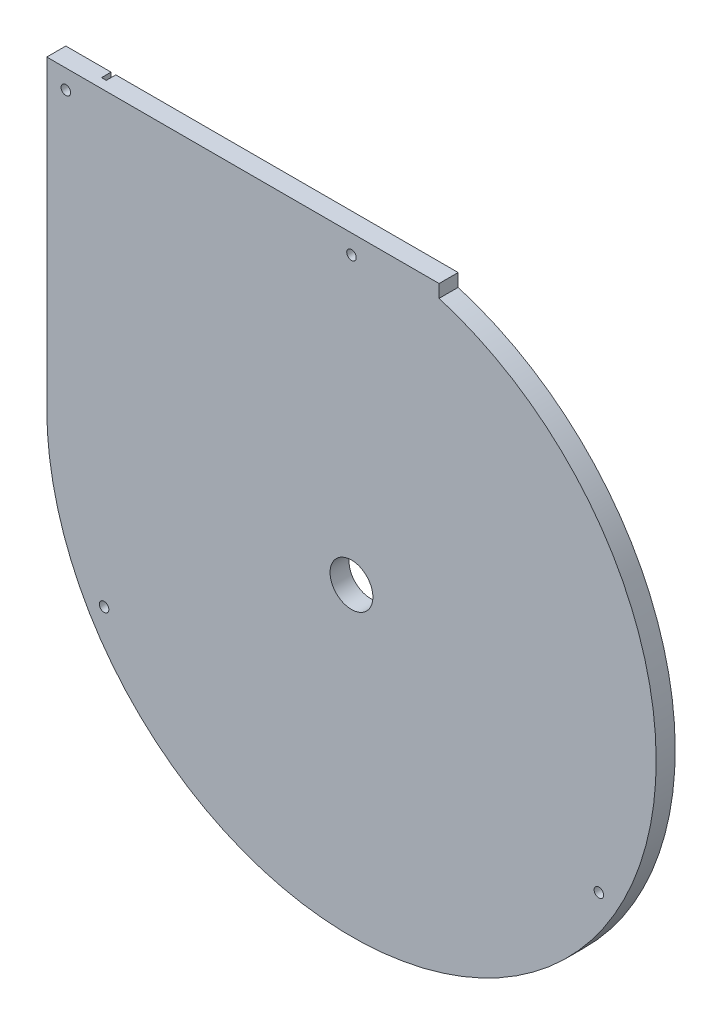
ISO-10303-21;
HEADER;
FILE_DESCRIPTION(('STEP AP214'),'2;1');
FILE_NAME('part.step','',(''),(''),'','','');
FILE_SCHEMA(('AUTOMOTIVE_DESIGN { 1 0 10303 214 1 1 1 1 }'));
ENDSEC;
DATA;
#1=APPLICATION_CONTEXT('core data for automotive mechanical design processes');
#2=APPLICATION_PROTOCOL_DEFINITION('international standard','automotive_design',2000,#1);
#3=PRODUCT_CONTEXT('',#1,'mechanical');
#4=PRODUCT('Part','Part','',(#3));
#5=PRODUCT_RELATED_PRODUCT_CATEGORY('part','',(#4));
#6=PRODUCT_DEFINITION_FORMATION('','',#4);
#7=PRODUCT_DEFINITION_CONTEXT('part definition',#1,'design');
#8=PRODUCT_DEFINITION('design','',#6,#7);
#9=PRODUCT_DEFINITION_SHAPE('','',#8);
#10=(LENGTH_UNIT() NAMED_UNIT(*) SI_UNIT(.MILLI.,.METRE.));
#11=(NAMED_UNIT(*) PLANE_ANGLE_UNIT() SI_UNIT($,.RADIAN.));
#12=(NAMED_UNIT(*) SI_UNIT($,.STERADIAN.) SOLID_ANGLE_UNIT());
#13=UNCERTAINTY_MEASURE_WITH_UNIT(LENGTH_MEASURE(1.E-05),#10,'distance_accuracy_value','');
#14=(GEOMETRIC_REPRESENTATION_CONTEXT(3) GLOBAL_UNCERTAINTY_ASSIGNED_CONTEXT((#13)) GLOBAL_UNIT_ASSIGNED_CONTEXT((#10,
#11,#12)) REPRESENTATION_CONTEXT('',''));
#15=CARTESIAN_POINT('',(0.,0.,0.));
#16=DIRECTION('',(0.,0.,1.));
#17=DIRECTION('',(1.,0.,0.));
#18=AXIS2_PLACEMENT_3D('',#15,#16,#17);
#19=CARTESIAN_POINT('',(0.,0.,12.7));
#20=DIRECTION('',(0.,0.,1.));
#21=DIRECTION('',(1.,0.,0.));
#22=AXIS2_PLACEMENT_3D('',#19,#20,#21);
#23=PLANE('',#22);
#24=CARTESIAN_POINT('',(0.,190.5,12.7));
#25=DIRECTION('',(0.,0.,-1.));
#26=DIRECTION('',(-1.,0.,0.));
#27=AXIS2_PLACEMENT_3D('',#24,#25,#26);
#28=CIRCLE('',#27,3.175);
#29=CARTESIAN_POINT('',(-3.17499999999999,190.5,12.7));
#30=VERTEX_POINT('',#29);
#31=EDGE_CURVE('E427',#30,#30,#28,.T.);
#32=ORIENTED_EDGE('',*,*,#31,.T.);
#33=EDGE_LOOP('',(#32));
#34=FACE_BOUND('',#33,.T.);
#35=CARTESIAN_POINT('',(-164.977839420936,-95.2500000000001,12.7));
#36=DIRECTION('',(0.,0.,-1.));
#37=DIRECTION('',(-1.,0.,0.));
#38=AXIS2_PLACEMENT_3D('',#35,#36,#37);
#39=CIRCLE('',#38,3.175);
#40=CARTESIAN_POINT('',(-168.152839420935,-95.2500000000001,12.7));
#41=VERTEX_POINT('',#40);
#42=EDGE_CURVE('E431',#41,#41,#39,.T.);
#43=ORIENTED_EDGE('',*,*,#42,.T.);
#44=EDGE_LOOP('',(#43));
#45=FACE_BOUND('',#44,.T.);
#46=CARTESIAN_POINT('',(-190.5,190.5,12.7));
#47=DIRECTION('',(0.,0.,-1.));
#48=DIRECTION('',(-1.,0.,0.));
#49=AXIS2_PLACEMENT_3D('',#46,#47,#48);
#50=CIRCLE('',#49,3.175);
#51=CARTESIAN_POINT('',(-193.675,190.5,12.7));
#52=VERTEX_POINT('',#51);
#53=EDGE_CURVE('E440',#52,#52,#50,.T.);
#54=ORIENTED_EDGE('',*,*,#53,.T.);
#55=EDGE_LOOP('',(#54));
#56=FACE_BOUND('',#55,.T.);
#57=CARTESIAN_POINT('',(164.977839420936,-95.25,12.7));
#58=DIRECTION('',(0.,0.,-1.));
#59=DIRECTION('',(-1.,0.,0.));
#60=AXIS2_PLACEMENT_3D('',#57,#58,#59);
#61=CIRCLE('',#60,3.175);
#62=CARTESIAN_POINT('',(161.802839420936,-95.25,12.7));
#63=VERTEX_POINT('',#62);
#64=EDGE_CURVE('E183',#63,#63,#61,.T.);
#65=ORIENTED_EDGE('',*,*,#64,.T.);
#66=EDGE_LOOP('',(#65));
#67=FACE_BOUND('',#66,.T.);
#68=DIRECTION('',(0.,1.,0.));
#69=VECTOR('',#68,1.);
#70=CARTESIAN_POINT('',(58.4327048944713,1.88963453154846E-13,12.7));
#71=LINE('',#70,#69);
#72=CARTESIAN_POINT('',(58.4327048944707,194.617211465779,12.7));
#73=VERTEX_POINT('',#72);
#74=CARTESIAN_POINT('',(58.4327048944707,203.2,12.7));
#75=VERTEX_POINT('',#74);
#76=EDGE_CURVE('E155',#73,#75,#71,.T.);
#77=ORIENTED_EDGE('',*,*,#76,.T.);
#78=DIRECTION('',(-1.,0.,0.));
#79=VECTOR('',#78,1.);
#80=CARTESIAN_POINT('',(203.2,203.2,12.7));
#81=LINE('',#80,#79);
#82=CARTESIAN_POINT('',(-203.2,203.2,12.7));
#83=VERTEX_POINT('',#82);
#84=EDGE_CURVE('E82',#75,#83,#81,.T.);
#85=ORIENTED_EDGE('',*,*,#84,.T.);
#86=DIRECTION('',(0.,-1.,0.));
#87=VECTOR('',#86,1.);
#88=CARTESIAN_POINT('',(-203.2,-203.2,12.7));
#89=LINE('',#88,#87);
#90=CARTESIAN_POINT('',(-203.2,0.,12.7));
#91=VERTEX_POINT('',#90);
#92=EDGE_CURVE('E158',#83,#91,#89,.T.);
#93=ORIENTED_EDGE('',*,*,#92,.T.);
#94=CARTESIAN_POINT('',(0.,0.,12.7));
#95=DIRECTION('',(0.,0.,-1.));
#96=DIRECTION('',(-1.,0.,0.));
#97=AXIS2_PLACEMENT_3D('',#94,#95,#96);
#98=CIRCLE('',#97,203.2);
#99=EDGE_CURVE('E151',#91,#73,#98,.F.);
#100=ORIENTED_EDGE('',*,*,#99,.T.);
#101=EDGE_LOOP('',(#77,#85,#93,#100));
#102=FACE_BOUND('',#101,.T.);
#103=CARTESIAN_POINT('',(0.,0.,12.7));
#104=DIRECTION('',(0.,0.,-1.));
#105=DIRECTION('',(-1.,0.,0.));
#106=AXIS2_PLACEMENT_3D('',#103,#104,#105);
#107=CIRCLE('',#106,14.2875);
#108=CARTESIAN_POINT('',(-14.2875,0.,12.7));
#109=VERTEX_POINT('',#108);
#110=EDGE_CURVE('E172',#109,#109,#107,.T.);
#111=ORIENTED_EDGE('',*,*,#110,.T.);
#112=EDGE_LOOP('',(#111));
#113=FACE_BOUND('',#112,.T.);
#114=ADVANCED_FACE('F74',(#34,#45,#56,#67,#102,#113),#23,.T.);
#115=CARTESIAN_POINT('',(0.,0.,0.));
#116=DIRECTION('',(0.,0.,1.));
#117=DIRECTION('',(1.,0.,0.));
#118=AXIS2_PLACEMENT_3D('',#115,#116,#117);
#119=PLANE('',#118);
#120=CARTESIAN_POINT('',(0.,190.5,0.));
#121=DIRECTION('',(0.,0.,-1.));
#122=DIRECTION('',(-1.,0.,0.));
#123=AXIS2_PLACEMENT_3D('',#120,#121,#122);
#124=CIRCLE('',#123,3.175);
#125=CARTESIAN_POINT('',(-3.17499999999999,190.5,0.));
#126=VERTEX_POINT('',#125);
#127=EDGE_CURVE('E430',#126,#126,#124,.T.);
#128=ORIENTED_EDGE('',*,*,#127,.F.);
#129=EDGE_LOOP('',(#128));
#130=FACE_BOUND('',#129,.T.);
#131=CARTESIAN_POINT('',(-164.977839420936,-95.2500000000001,0.));
#132=DIRECTION('',(0.,0.,-1.));
#133=DIRECTION('',(-1.,0.,0.));
#134=AXIS2_PLACEMENT_3D('',#131,#132,#133);
#135=CIRCLE('',#134,3.175);
#136=CARTESIAN_POINT('',(-168.152839420935,-95.2500000000001,0.));
#137=VERTEX_POINT('',#136);
#138=EDGE_CURVE('E435',#137,#137,#135,.T.);
#139=ORIENTED_EDGE('',*,*,#138,.F.);
#140=EDGE_LOOP('',(#139));
#141=FACE_BOUND('',#140,.T.);
#142=CARTESIAN_POINT('',(-190.5,190.5,0.));
#143=DIRECTION('',(0.,0.,-1.));
#144=DIRECTION('',(-1.,0.,0.));
#145=AXIS2_PLACEMENT_3D('',#142,#143,#144);
#146=CIRCLE('',#145,3.175);
#147=CARTESIAN_POINT('',(-193.675,190.5,0.));
#148=VERTEX_POINT('',#147);
#149=EDGE_CURVE('E443',#148,#148,#146,.T.);
#150=ORIENTED_EDGE('',*,*,#149,.F.);
#151=EDGE_LOOP('',(#150));
#152=FACE_BOUND('',#151,.T.);
#153=CARTESIAN_POINT('',(164.977839420936,-95.25,0.));
#154=DIRECTION('',(0.,0.,-1.));
#155=DIRECTION('',(-1.,0.,0.));
#156=AXIS2_PLACEMENT_3D('',#153,#154,#155);
#157=CIRCLE('',#156,3.175);
#158=CARTESIAN_POINT('',(161.802839420936,-95.25,0.));
#159=VERTEX_POINT('',#158);
#160=EDGE_CURVE('E175',#159,#159,#157,.T.);
#161=ORIENTED_EDGE('',*,*,#160,.F.);
#162=EDGE_LOOP('',(#161));
#163=FACE_BOUND('',#162,.T.);
#164=CARTESIAN_POINT('',(0.,0.,0.));
#165=DIRECTION('',(0.,0.,-1.));
#166=DIRECTION('',(-1.,0.,0.));
#167=AXIS2_PLACEMENT_3D('',#164,#165,#166);
#168=CIRCLE('',#167,14.2875);
#169=CARTESIAN_POINT('',(-14.2875,0.,0.));
#170=VERTEX_POINT('',#169);
#171=EDGE_CURVE('E181',#170,#170,#168,.T.);
#172=ORIENTED_EDGE('',*,*,#171,.F.);
#173=EDGE_LOOP('',(#172));
#174=FACE_BOUND('',#173,.T.);
#175=DIRECTION('',(-1.,0.,0.));
#176=VECTOR('',#175,1.);
#177=CARTESIAN_POINT('',(203.2,203.2,0.));
#178=LINE('',#177,#176);
#179=CARTESIAN_POINT('',(58.4327048944707,203.2,0.));
#180=VERTEX_POINT('',#179);
#181=CARTESIAN_POINT('',(-169.8625,203.2,0.));
#182=VERTEX_POINT('',#181);
#183=EDGE_CURVE('E233',#180,#182,#178,.T.);
#184=ORIENTED_EDGE('',*,*,#183,.F.);
#185=DIRECTION('',(0.,1.,0.));
#186=VECTOR('',#185,1.);
#187=CARTESIAN_POINT('',(58.4327048944713,1.88963453154846E-13,0.));
#188=LINE('',#187,#186);
#189=CARTESIAN_POINT('',(58.4327048944707,194.617211465779,0.));
#190=VERTEX_POINT('',#189);
#191=EDGE_CURVE('E170',#190,#180,#188,.T.);
#192=ORIENTED_EDGE('',*,*,#191,.F.);
#193=CARTESIAN_POINT('',(0.,0.,0.));
#194=DIRECTION('',(0.,0.,-1.));
#195=DIRECTION('',(-1.,0.,0.));
#196=AXIS2_PLACEMENT_3D('',#193,#194,#195);
#197=CIRCLE('',#196,203.2);
#198=CARTESIAN_POINT('',(-203.2,0.,0.));
#199=VERTEX_POINT('',#198);
#200=EDGE_CURVE('E159',#199,#190,#197,.F.);
#201=ORIENTED_EDGE('',*,*,#200,.F.);
#202=DIRECTION('',(0.,-1.,0.));
#203=VECTOR('',#202,1.);
#204=CARTESIAN_POINT('',(-203.2,-203.2,0.));
#205=LINE('',#204,#203);
#206=CARTESIAN_POINT('',(-203.2,203.2,0.));
#207=VERTEX_POINT('',#206);
#208=EDGE_CURVE('E220',#207,#199,#205,.T.);
#209=ORIENTED_EDGE('',*,*,#208,.F.);
#210=CARTESIAN_POINT('',(-173.0375,203.2,0.));
#211=VERTEX_POINT('',#210);
#212=EDGE_CURVE('E236',#211,#207,#178,.T.);
#213=ORIENTED_EDGE('',*,*,#212,.F.);
#214=DIRECTION('',(0.,1.,0.));
#215=VECTOR('',#214,1.);
#216=CARTESIAN_POINT('',(-173.0375,0.,0.));
#217=LINE('',#216,#215);
#218=CARTESIAN_POINT('',(-173.0375,0.,0.));
#219=VERTEX_POINT('',#218);
#220=EDGE_CURVE('E208',#219,#211,#217,.T.);
#221=ORIENTED_EDGE('',*,*,#220,.F.);
#222=CARTESIAN_POINT('',(0.,0.,0.));
#223=DIRECTION('',(0.,0.,-1.));
#224=DIRECTION('',(-1.,0.,0.));
#225=AXIS2_PLACEMENT_3D('',#222,#223,#224);
#226=CIRCLE('',#225,173.0375);
#227=CARTESIAN_POINT('',(-18.0276835570673,172.095842575631,0.));
#228=VERTEX_POINT('',#227);
#229=EDGE_CURVE('E97',#228,#219,#226,.T.);
#230=ORIENTED_EDGE('',*,*,#229,.F.);
#231=DIRECTION('',(-0.104183680167983,0.994558073109185,0.));
#232=VECTOR('',#231,1.);
#233=CARTESIAN_POINT('',(-17.696900372534,168.938120693509,0.));
#234=LINE('',#233,#232);
#235=CARTESIAN_POINT('',(-17.696900372534,168.938120693509,0.));
#236=VERTEX_POINT('',#235);
#237=EDGE_CURVE('E191',#236,#228,#234,.T.);
#238=ORIENTED_EDGE('',*,*,#237,.F.);
#239=CARTESIAN_POINT('',(0.,0.,0.));
#240=DIRECTION('',(0.,0.,1.));
#241=DIRECTION('',(-1.,0.,0.));
#242=AXIS2_PLACEMENT_3D('',#239,#240,#241);
#243=CIRCLE('',#242,169.8625);
#244=CARTESIAN_POINT('',(-169.8625,0.,0.));
#245=VERTEX_POINT('',#244);
#246=EDGE_CURVE('E213',#245,#236,#243,.T.);
#247=ORIENTED_EDGE('',*,*,#246,.F.);
#248=DIRECTION('',(0.,-1.,0.));
#249=VECTOR('',#248,1.);
#250=CARTESIAN_POINT('',(-169.8625,203.2,0.));
#251=LINE('',#250,#249);
#252=EDGE_CURVE('E210',#182,#245,#251,.T.);
#253=ORIENTED_EDGE('',*,*,#252,.F.);
#254=EDGE_LOOP('',(#184,#192,#201,#209,#213,#221,#230,#238,#247,#253));
#255=FACE_BOUND('',#254,.T.);
#256=ADVANCED_FACE('F248',(#130,#141,#152,#163,#174,#255),#119,.F.);
#257=CARTESIAN_POINT('',(-203.2,-203.2,12.7));
#258=DIRECTION('',(1.,0.,0.));
#259=DIRECTION('',(0.,0.,-1.));
#260=AXIS2_PLACEMENT_3D('',#257,#258,#259);
#261=PLANE('',#260);
#262=ORIENTED_EDGE('',*,*,#208,.T.);
#263=DIRECTION('',(0.,0.,-1.));
#264=VECTOR('',#263,1.);
#265=CARTESIAN_POINT('',(-203.2,0.,12.7));
#266=LINE('',#265,#264);
#267=EDGE_CURVE('E89',#91,#199,#266,.T.);
#268=ORIENTED_EDGE('',*,*,#267,.F.);
#269=ORIENTED_EDGE('',*,*,#92,.F.);
#270=DIRECTION('',(0.,0.,-1.));
#271=VECTOR('',#270,1.);
#272=CARTESIAN_POINT('',(-203.2,203.2,12.7));
#273=LINE('',#272,#271);
#274=EDGE_CURVE('E12',#83,#207,#273,.T.);
#275=ORIENTED_EDGE('',*,*,#274,.T.);
#276=EDGE_LOOP('',(#262,#268,#269,#275));
#277=FACE_BOUND('',#276,.T.);
#278=ADVANCED_FACE('F76',(#277),#261,.F.);
#279=CARTESIAN_POINT('',(203.2,203.2,12.7));
#280=DIRECTION('',(0.,-1.,0.));
#281=DIRECTION('',(1.,0.,0.));
#282=AXIS2_PLACEMENT_3D('',#279,#280,#281);
#283=PLANE('',#282);
#284=ORIENTED_EDGE('',*,*,#84,.F.);
#285=DIRECTION('',(0.,0.,-1.));
#286=VECTOR('',#285,1.);
#287=CARTESIAN_POINT('',(58.4327048944707,203.2,12.7));
#288=LINE('',#287,#286);
#289=EDGE_CURVE('E166',#75,#180,#288,.T.);
#290=ORIENTED_EDGE('',*,*,#289,.T.);
#291=ORIENTED_EDGE('',*,*,#183,.T.);
#292=DIRECTION('',(0.,0.,-1.));
#293=VECTOR('',#292,1.);
#294=CARTESIAN_POINT('',(-169.8625,203.2,6.35));
#295=LINE('',#294,#293);
#296=CARTESIAN_POINT('',(-169.8625,203.2,6.35));
#297=VERTEX_POINT('',#296);
#298=EDGE_CURVE('E225',#297,#182,#295,.T.);
#299=ORIENTED_EDGE('',*,*,#298,.F.);
#300=DIRECTION('',(1.,0.,0.));
#301=VECTOR('',#300,1.);
#302=CARTESIAN_POINT('',(-173.0375,203.2,6.35));
#303=LINE('',#302,#301);
#304=CARTESIAN_POINT('',(-173.0375,203.2,6.35));
#305=VERTEX_POINT('',#304);
#306=EDGE_CURVE('E194',#305,#297,#303,.T.);
#307=ORIENTED_EDGE('',*,*,#306,.F.);
#308=DIRECTION('',(0.,0.,-1.));
#309=VECTOR('',#308,1.);
#310=CARTESIAN_POINT('',(-173.0375,203.2,6.35));
#311=LINE('',#310,#309);
#312=EDGE_CURVE('E228',#305,#211,#311,.T.);
#313=ORIENTED_EDGE('',*,*,#312,.T.);
#314=ORIENTED_EDGE('',*,*,#212,.T.);
#315=ORIENTED_EDGE('',*,*,#274,.F.);
#316=EDGE_LOOP('',(#284,#290,#291,#299,#307,#313,#314,#315));
#317=FACE_BOUND('',#316,.T.);
#318=ADVANCED_FACE('F242',(#317),#283,.F.);
#319=CARTESIAN_POINT('',(0.,0.,6.35));
#320=DIRECTION('',(0.,0.,-1.));
#321=DIRECTION('',(-1.,0.,0.));
#322=AXIS2_PLACEMENT_3D('',#319,#320,#321);
#323=CYLINDRICAL_SURFACE('',#322,173.0375);
#324=ORIENTED_EDGE('',*,*,#229,.T.);
#325=DIRECTION('',(0.,0.,-1.));
#326=VECTOR('',#325,1.);
#327=CARTESIAN_POINT('',(-173.0375,0.,6.35));
#328=LINE('',#327,#326);
#329=CARTESIAN_POINT('',(-173.0375,0.,6.35));
#330=VERTEX_POINT('',#329);
#331=EDGE_CURVE('E206',#330,#219,#328,.T.);
#332=ORIENTED_EDGE('',*,*,#331,.F.);
#333=CARTESIAN_POINT('',(0.,0.,6.35));
#334=DIRECTION('',(0.,0.,-1.));
#335=DIRECTION('',(-1.,0.,0.));
#336=AXIS2_PLACEMENT_3D('',#333,#334,#335);
#337=CIRCLE('',#336,173.0375);
#338=CARTESIAN_POINT('',(-18.0276835570673,172.095842575631,6.35));
#339=VERTEX_POINT('',#338);
#340=EDGE_CURVE('E187',#339,#330,#337,.T.);
#341=ORIENTED_EDGE('',*,*,#340,.F.);
#342=DIRECTION('',(0.,0.,-1.));
#343=VECTOR('',#342,1.);
#344=CARTESIAN_POINT('',(-18.0276835570673,172.095842575631,6.35));
#345=LINE('',#344,#343);
#346=EDGE_CURVE('E218',#339,#228,#345,.T.);
#347=ORIENTED_EDGE('',*,*,#346,.T.);
#348=EDGE_LOOP('',(#324,#332,#341,#347));
#349=FACE_BOUND('',#348,.T.);
#350=ADVANCED_FACE('F273',(#349),#323,.F.);
#351=CARTESIAN_POINT('',(-17.696900372534,168.938120693509,6.35));
#352=DIRECTION('',(-0.994558073109185,-0.104183680167983,0.));
#353=DIRECTION('',(0.104183680167983,-0.994558073109185,0.));
#354=AXIS2_PLACEMENT_3D('',#351,#352,#353);
#355=PLANE('',#354);
#356=ORIENTED_EDGE('',*,*,#237,.T.);
#357=ORIENTED_EDGE('',*,*,#346,.F.);
#358=DIRECTION('',(-0.104183680167983,0.994558073109185,0.));
#359=VECTOR('',#358,1.);
#360=CARTESIAN_POINT('',(-17.696900372534,168.938120693509,6.35));
#361=LINE('',#360,#359);
#362=CARTESIAN_POINT('',(-17.696900372534,168.938120693509,6.35));
#363=VERTEX_POINT('',#362);
#364=EDGE_CURVE('E203',#363,#339,#361,.T.);
#365=ORIENTED_EDGE('',*,*,#364,.F.);
#366=DIRECTION('',(0.,0.,-1.));
#367=VECTOR('',#366,1.);
#368=CARTESIAN_POINT('',(-17.696900372534,168.938120693509,6.35));
#369=LINE('',#368,#367);
#370=EDGE_CURVE('E221',#363,#236,#369,.T.);
#371=ORIENTED_EDGE('',*,*,#370,.T.);
#372=EDGE_LOOP('',(#356,#357,#365,#371));
#373=FACE_BOUND('',#372,.T.);
#374=ADVANCED_FACE('F262',(#373),#355,.F.);
#375=CARTESIAN_POINT('',(0.,0.,6.35));
#376=DIRECTION('',(0.,0.,-1.));
#377=DIRECTION('',(-1.,0.,0.));
#378=AXIS2_PLACEMENT_3D('',#375,#376,#377);
#379=CYLINDRICAL_SURFACE('',#378,169.8625);
#380=ORIENTED_EDGE('',*,*,#246,.T.);
#381=ORIENTED_EDGE('',*,*,#370,.F.);
#382=CARTESIAN_POINT('',(0.,0.,6.35));
#383=DIRECTION('',(0.,0.,1.));
#384=DIRECTION('',(-1.,0.,0.));
#385=AXIS2_PLACEMENT_3D('',#382,#383,#384);
#386=CIRCLE('',#385,169.8625);
#387=CARTESIAN_POINT('',(-169.8625,0.,6.35));
#388=VERTEX_POINT('',#387);
#389=EDGE_CURVE('E200',#388,#363,#386,.T.);
#390=ORIENTED_EDGE('',*,*,#389,.F.);
#391=DIRECTION('',(0.,0.,-1.));
#392=VECTOR('',#391,1.);
#393=CARTESIAN_POINT('',(-169.8625,0.,6.35));
#394=LINE('',#393,#392);
#395=EDGE_CURVE('E223',#388,#245,#394,.T.);
#396=ORIENTED_EDGE('',*,*,#395,.T.);
#397=EDGE_LOOP('',(#380,#381,#390,#396));
#398=FACE_BOUND('',#397,.T.);
#399=ADVANCED_FACE('F265',(#398),#379,.T.);
#400=CARTESIAN_POINT('',(-169.8625,203.2,6.35));
#401=DIRECTION('',(1.,0.,0.));
#402=DIRECTION('',(0.,1.,0.));
#403=AXIS2_PLACEMENT_3D('',#400,#401,#402);
#404=PLANE('',#403);
#405=ORIENTED_EDGE('',*,*,#252,.T.);
#406=ORIENTED_EDGE('',*,*,#395,.F.);
#407=DIRECTION('',(0.,-1.,0.));
#408=VECTOR('',#407,1.);
#409=CARTESIAN_POINT('',(-169.8625,203.2,6.35));
#410=LINE('',#409,#408);
#411=EDGE_CURVE('E197',#297,#388,#410,.T.);
#412=ORIENTED_EDGE('',*,*,#411,.F.);
#413=ORIENTED_EDGE('',*,*,#298,.T.);
#414=EDGE_LOOP('',(#405,#406,#412,#413));
#415=FACE_BOUND('',#414,.T.);
#416=ADVANCED_FACE('F253',(#415),#404,.F.);
#417=CARTESIAN_POINT('',(-173.0375,0.,6.35));
#418=DIRECTION('',(-1.,0.,0.));
#419=DIRECTION('',(0.,0.,1.));
#420=AXIS2_PLACEMENT_3D('',#417,#418,#419);
#421=PLANE('',#420);
#422=ORIENTED_EDGE('',*,*,#220,.T.);
#423=ORIENTED_EDGE('',*,*,#312,.F.);
#424=DIRECTION('',(0.,1.,0.));
#425=VECTOR('',#424,1.);
#426=CARTESIAN_POINT('',(-173.0375,0.,6.35));
#427=LINE('',#426,#425);
#428=EDGE_CURVE('E190',#330,#305,#427,.T.);
#429=ORIENTED_EDGE('',*,*,#428,.F.);
#430=ORIENTED_EDGE('',*,*,#331,.T.);
#431=EDGE_LOOP('',(#422,#423,#429,#430));
#432=FACE_BOUND('',#431,.T.);
#433=ADVANCED_FACE('F260',(#432),#421,.F.);
#434=CARTESIAN_POINT('',(0.,0.,6.35));
#435=DIRECTION('',(0.,0.,-1.));
#436=DIRECTION('',(-1.,0.,0.));
#437=AXIS2_PLACEMENT_3D('',#434,#435,#436);
#438=PLANE('',#437);
#439=ORIENTED_EDGE('',*,*,#340,.T.);
#440=ORIENTED_EDGE('',*,*,#428,.T.);
#441=ORIENTED_EDGE('',*,*,#306,.T.);
#442=ORIENTED_EDGE('',*,*,#411,.T.);
#443=ORIENTED_EDGE('',*,*,#389,.T.);
#444=ORIENTED_EDGE('',*,*,#364,.T.);
#445=EDGE_LOOP('',(#439,#440,#441,#442,#443,#444));
#446=FACE_BOUND('',#445,.T.);
#447=ADVANCED_FACE('F256',(#446),#438,.T.);
#448=CARTESIAN_POINT('',(0.,0.,12.7));
#449=DIRECTION('',(0.,0.,-1.));
#450=DIRECTION('',(-1.,0.,0.));
#451=AXIS2_PLACEMENT_3D('',#448,#449,#450);
#452=CYLINDRICAL_SURFACE('',#451,203.2);
#453=ORIENTED_EDGE('',*,*,#200,.T.);
#454=DIRECTION('',(0.,0.,-1.));
#455=VECTOR('',#454,1.);
#456=CARTESIAN_POINT('',(58.4327048944707,194.617211465779,12.7));
#457=LINE('',#456,#455);
#458=EDGE_CURVE('E162',#73,#190,#457,.T.);
#459=ORIENTED_EDGE('',*,*,#458,.F.);
#460=ORIENTED_EDGE('',*,*,#99,.F.);
#461=ORIENTED_EDGE('',*,*,#267,.T.);
#462=EDGE_LOOP('',(#453,#459,#460,#461));
#463=FACE_BOUND('',#462,.T.);
#464=ADVANCED_FACE('F163',(#463),#452,.T.);
#465=CARTESIAN_POINT('',(58.4327048944713,1.88963453154846E-13,12.7));
#466=DIRECTION('',(-1.,0.,0.));
#467=DIRECTION('',(0.,-1.,0.));
#468=AXIS2_PLACEMENT_3D('',#465,#466,#467);
#469=PLANE('',#468);
#470=ORIENTED_EDGE('',*,*,#191,.T.);
#471=ORIENTED_EDGE('',*,*,#289,.F.);
#472=ORIENTED_EDGE('',*,*,#76,.F.);
#473=ORIENTED_EDGE('',*,*,#458,.T.);
#474=EDGE_LOOP('',(#470,#471,#472,#473));
#475=FACE_BOUND('',#474,.T.);
#476=ADVANCED_FACE('F168',(#475),#469,.F.);
#477=CARTESIAN_POINT('',(0.,0.,12.7));
#478=DIRECTION('',(0.,0.,-1.));
#479=DIRECTION('',(-1.,0.,0.));
#480=AXIS2_PLACEMENT_3D('',#477,#478,#479);
#481=CYLINDRICAL_SURFACE('',#480,14.2875);
#482=ORIENTED_EDGE('',*,*,#110,.F.);
#483=EDGE_LOOP('',(#482));
#484=FACE_BOUND('',#483,.T.);
#485=ORIENTED_EDGE('',*,*,#171,.T.);
#486=EDGE_LOOP('',(#485));
#487=FACE_BOUND('',#486,.T.);
#488=ADVANCED_FACE('F314',(#484,#487),#481,.F.);
#489=CARTESIAN_POINT('',(164.977839420936,-95.25,12.7));
#490=DIRECTION('',(0.,0.,-1.));
#491=DIRECTION('',(-1.,0.,0.));
#492=AXIS2_PLACEMENT_3D('',#489,#490,#491);
#493=CYLINDRICAL_SURFACE('',#492,3.175);
#494=ORIENTED_EDGE('',*,*,#64,.F.);
#495=EDGE_LOOP('',(#494));
#496=FACE_BOUND('',#495,.T.);
#497=ORIENTED_EDGE('',*,*,#160,.T.);
#498=EDGE_LOOP('',(#497));
#499=FACE_BOUND('',#498,.T.);
#500=ADVANCED_FACE('F308',(#496,#499),#493,.F.);
#501=CARTESIAN_POINT('',(-190.5,190.5,12.7));
#502=DIRECTION('',(0.,0.,-1.));
#503=DIRECTION('',(-1.,0.,0.));
#504=AXIS2_PLACEMENT_3D('',#501,#502,#503);
#505=CYLINDRICAL_SURFACE('',#504,3.175);
#506=ORIENTED_EDGE('',*,*,#53,.F.);
#507=EDGE_LOOP('',(#506));
#508=FACE_BOUND('',#507,.T.);
#509=ORIENTED_EDGE('',*,*,#149,.T.);
#510=EDGE_LOOP('',(#509));
#511=FACE_BOUND('',#510,.T.);
#512=ADVANCED_FACE('F313',(#508,#511),#505,.F.);
#513=CARTESIAN_POINT('',(-164.977839420936,-95.2500000000001,12.7));
#514=DIRECTION('',(0.,0.,-1.));
#515=DIRECTION('',(-1.,0.,0.));
#516=AXIS2_PLACEMENT_3D('',#513,#514,#515);
#517=CYLINDRICAL_SURFACE('',#516,3.175);
#518=ORIENTED_EDGE('',*,*,#42,.F.);
#519=EDGE_LOOP('',(#518));
#520=FACE_BOUND('',#519,.T.);
#521=ORIENTED_EDGE('',*,*,#138,.T.);
#522=EDGE_LOOP('',(#521));
#523=FACE_BOUND('',#522,.T.);
#524=ADVANCED_FACE('F326',(#520,#523),#517,.F.);
#525=CARTESIAN_POINT('',(0.,190.5,12.7));
#526=DIRECTION('',(0.,0.,-1.));
#527=DIRECTION('',(-1.,0.,0.));
#528=AXIS2_PLACEMENT_3D('',#525,#526,#527);
#529=CYLINDRICAL_SURFACE('',#528,3.175);
#530=ORIENTED_EDGE('',*,*,#31,.F.);
#531=EDGE_LOOP('',(#530));
#532=FACE_BOUND('',#531,.T.);
#533=ORIENTED_EDGE('',*,*,#127,.T.);
#534=EDGE_LOOP('',(#533));
#535=FACE_BOUND('',#534,.T.);
#536=ADVANCED_FACE('F336',(#532,#535),#529,.F.);
#537=CLOSED_SHELL('',(#114,#256,#278,#318,#350,#374,#399,#416,#433,#447,#464,#476,#488,#500,
#512,#524,#536));
#538=MANIFOLD_SOLID_BREP('B2',#537);
#539=ADVANCED_BREP_SHAPE_REPRESENTATION('',(#18,#538),#14);
#540=SHAPE_DEFINITION_REPRESENTATION(#9,#539);
ENDSEC;
END-ISO-10303-21;
